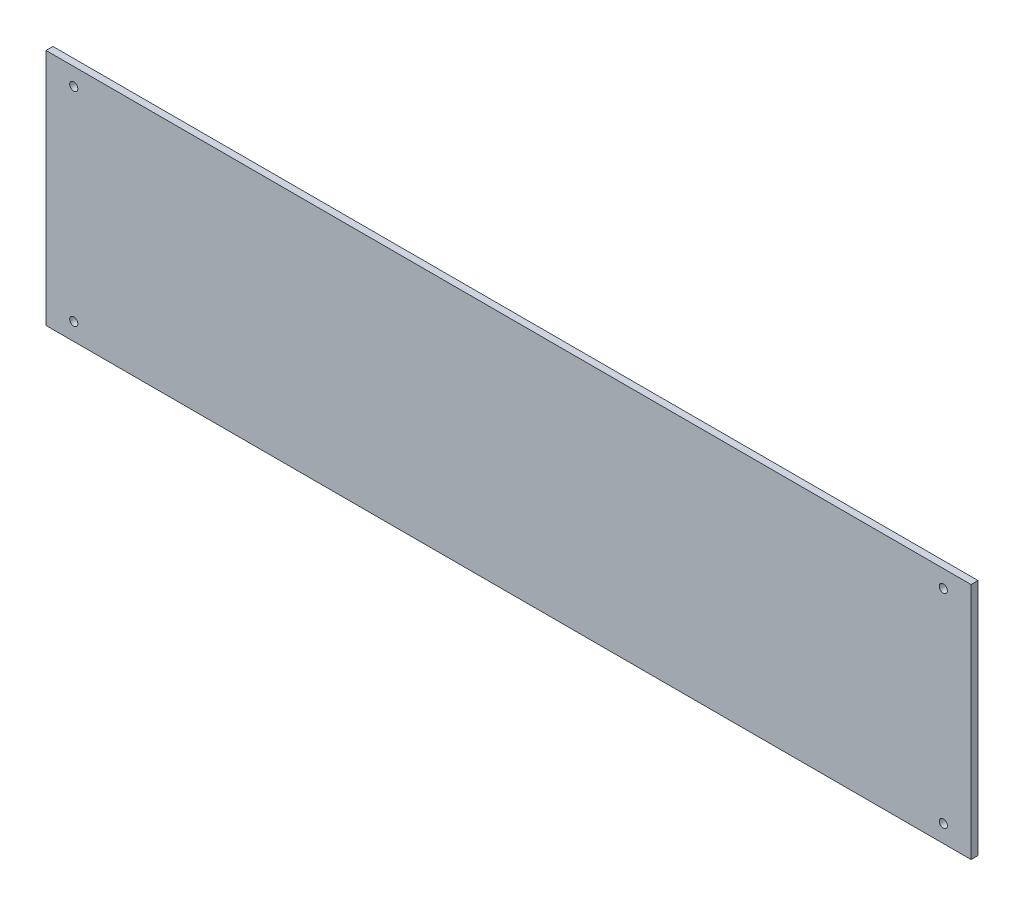
ISO-10303-21;
HEADER;
FILE_DESCRIPTION(('STEP AP214'),'2;1');
FILE_NAME('part.step','',(''),(''),'','','');
FILE_SCHEMA(('AUTOMOTIVE_DESIGN { 1 0 10303 214 1 1 1 1 }'));
ENDSEC;
DATA;
#1=APPLICATION_CONTEXT('core data for automotive mechanical design processes');
#2=APPLICATION_PROTOCOL_DEFINITION('international standard','automotive_design',2000,#1);
#3=PRODUCT_CONTEXT('',#1,'mechanical');
#4=PRODUCT('Part','Part','',(#3));
#5=PRODUCT_RELATED_PRODUCT_CATEGORY('part','',(#4));
#6=PRODUCT_DEFINITION_FORMATION('','',#4);
#7=PRODUCT_DEFINITION_CONTEXT('part definition',#1,'design');
#8=PRODUCT_DEFINITION('design','',#6,#7);
#9=PRODUCT_DEFINITION_SHAPE('','',#8);
#10=(LENGTH_UNIT() NAMED_UNIT(*) SI_UNIT(.MILLI.,.METRE.));
#11=(NAMED_UNIT(*) PLANE_ANGLE_UNIT() SI_UNIT($,.RADIAN.));
#12=(NAMED_UNIT(*) SI_UNIT($,.STERADIAN.) SOLID_ANGLE_UNIT());
#13=UNCERTAINTY_MEASURE_WITH_UNIT(LENGTH_MEASURE(1.E-05),#10,'distance_accuracy_value','');
#14=(GEOMETRIC_REPRESENTATION_CONTEXT(3) GLOBAL_UNCERTAINTY_ASSIGNED_CONTEXT((#13)) GLOBAL_UNIT_ASSIGNED_CONTEXT((#10,
#11,#12)) REPRESENTATION_CONTEXT('',''));
#15=CARTESIAN_POINT('',(0.,0.,0.));
#16=DIRECTION('',(0.,0.,1.));
#17=DIRECTION('',(1.,0.,0.));
#18=AXIS2_PLACEMENT_3D('',#15,#16,#17);
#19=CARTESIAN_POINT('',(0.,0.,3.));
#20=DIRECTION('',(1.,0.,0.));
#21=DIRECTION('',(0.,0.,-1.));
#22=AXIS2_PLACEMENT_3D('',#19,#20,#21);
#23=PLANE('',#22);
#24=DIRECTION('',(0.,-1.,0.));
#25=VECTOR('',#24,1.);
#26=CARTESIAN_POINT('',(0.,0.,0.));
#27=LINE('',#26,#25);
#28=CARTESIAN_POINT('',(0.,100.,0.));
#29=VERTEX_POINT('',#28);
#30=CARTESIAN_POINT('',(0.,-3.,0.));
#31=VERTEX_POINT('',#30);
#32=EDGE_CURVE('E78',#29,#31,#27,.T.);
#33=ORIENTED_EDGE('',*,*,#32,.T.);
#34=DIRECTION('',(0.,0.,-1.));
#35=VECTOR('',#34,1.);
#36=CARTESIAN_POINT('',(0.,-3.,0.));
#37=LINE('',#36,#35);
#38=CARTESIAN_POINT('',(0.,-3.,3.));
#39=VERTEX_POINT('',#38);
#40=EDGE_CURVE('E81',#39,#31,#37,.T.);
#41=ORIENTED_EDGE('',*,*,#40,.F.);
#42=DIRECTION('',(0.,-1.,0.));
#43=VECTOR('',#42,1.);
#44=CARTESIAN_POINT('',(0.,0.,3.));
#45=LINE('',#44,#43);
#46=CARTESIAN_POINT('',(0.,100.,3.));
#47=VERTEX_POINT('',#46);
#48=EDGE_CURVE('E65',#47,#39,#45,.T.);
#49=ORIENTED_EDGE('',*,*,#48,.F.);
#50=DIRECTION('',(0.,0.,-1.));
#51=VECTOR('',#50,1.);
#52=CARTESIAN_POINT('',(0.,100.,3.));
#53=LINE('',#52,#51);
#54=EDGE_CURVE('E41',#47,#29,#53,.T.);
#55=ORIENTED_EDGE('',*,*,#54,.T.);
#56=EDGE_LOOP('',(#33,#41,#49,#55));
#57=FACE_BOUND('',#56,.T.);
#58=ADVANCED_FACE('F33',(#57),#23,.F.);
#59=CARTESIAN_POINT('',(400.,0.,3.));
#60=DIRECTION('',(-1.,0.,0.));
#61=DIRECTION('',(0.,0.,1.));
#62=AXIS2_PLACEMENT_3D('',#59,#60,#61);
#63=PLANE('',#62);
#64=DIRECTION('',(0.,1.,0.));
#65=VECTOR('',#64,1.);
#66=CARTESIAN_POINT('',(400.,0.,0.));
#67=LINE('',#66,#65);
#68=CARTESIAN_POINT('',(400.,-3.,0.));
#69=VERTEX_POINT('',#68);
#70=CARTESIAN_POINT('',(400.,100.,0.));
#71=VERTEX_POINT('',#70);
#72=EDGE_CURVE('E60',#69,#71,#67,.T.);
#73=ORIENTED_EDGE('',*,*,#72,.T.);
#74=DIRECTION('',(0.,0.,-1.));
#75=VECTOR('',#74,1.);
#76=CARTESIAN_POINT('',(400.,100.,3.));
#77=LINE('',#76,#75);
#78=CARTESIAN_POINT('',(400.,100.,3.));
#79=VERTEX_POINT('',#78);
#80=EDGE_CURVE('E11',#79,#71,#77,.T.);
#81=ORIENTED_EDGE('',*,*,#80,.F.);
#82=DIRECTION('',(0.,1.,0.));
#83=VECTOR('',#82,1.);
#84=CARTESIAN_POINT('',(400.,0.,3.));
#85=LINE('',#84,#83);
#86=CARTESIAN_POINT('',(400.,-3.,3.00000000000005));
#87=VERTEX_POINT('',#86);
#88=EDGE_CURVE('E123',#87,#79,#85,.T.);
#89=ORIENTED_EDGE('',*,*,#88,.F.);
#90=DIRECTION('',(0.,0.,1.));
#91=VECTOR('',#90,1.);
#92=CARTESIAN_POINT('',(400.,-3.,0.));
#93=LINE('',#92,#91);
#94=EDGE_CURVE('E91',#69,#87,#93,.T.);
#95=ORIENTED_EDGE('',*,*,#94,.F.);
#96=EDGE_LOOP('',(#73,#81,#89,#95));
#97=FACE_BOUND('',#96,.T.);
#98=ADVANCED_FACE('F130',(#97),#63,.F.);
#99=CARTESIAN_POINT('',(0.,100.,3.));
#100=DIRECTION('',(0.,-1.,0.));
#101=DIRECTION('',(0.,0.,-1.));
#102=AXIS2_PLACEMENT_3D('',#99,#100,#101);
#103=PLANE('',#102);
#104=DIRECTION('',(-1.,0.,0.));
#105=VECTOR('',#104,1.);
#106=CARTESIAN_POINT('',(0.,100.,0.));
#107=LINE('',#106,#105);
#108=EDGE_CURVE('E124',#71,#29,#107,.T.);
#109=ORIENTED_EDGE('',*,*,#108,.T.);
#110=ORIENTED_EDGE('',*,*,#54,.F.);
#111=DIRECTION('',(-1.,0.,0.));
#112=VECTOR('',#111,1.);
#113=CARTESIAN_POINT('',(0.,100.,3.));
#114=LINE('',#113,#112);
#115=EDGE_CURVE('E49',#79,#47,#114,.T.);
#116=ORIENTED_EDGE('',*,*,#115,.F.);
#117=ORIENTED_EDGE('',*,*,#80,.T.);
#118=EDGE_LOOP('',(#109,#110,#116,#117));
#119=FACE_BOUND('',#118,.T.);
#120=ADVANCED_FACE('F129',(#119),#103,.F.);
#121=CARTESIAN_POINT('',(0.,0.,3.));
#122=DIRECTION('',(0.,0.,-1.));
#123=DIRECTION('',(-1.,0.,0.));
#124=AXIS2_PLACEMENT_3D('',#121,#122,#123);
#125=PLANE('',#124);
#126=CARTESIAN_POINT('',(388.,4.5,3.));
#127=DIRECTION('',(0.,0.,-1.));
#128=DIRECTION('',(1.,0.,0.));
#129=AXIS2_PLACEMENT_3D('',#126,#127,#128);
#130=CIRCLE('',#129,1.74999999999998);
#131=CARTESIAN_POINT('',(389.75,4.5,3.));
#132=VERTEX_POINT('',#131);
#133=EDGE_CURVE('E100',#132,#132,#130,.T.);
#134=ORIENTED_EDGE('',*,*,#133,.T.);
#135=EDGE_LOOP('',(#134));
#136=FACE_BOUND('',#135,.T.);
#137=CARTESIAN_POINT('',(12.,92.5,3.));
#138=DIRECTION('',(0.,0.,-1.));
#139=DIRECTION('',(1.,0.,0.));
#140=AXIS2_PLACEMENT_3D('',#137,#138,#139);
#141=CIRCLE('',#140,1.74999999999998);
#142=CARTESIAN_POINT('',(13.75,92.5,3.));
#143=VERTEX_POINT('',#142);
#144=EDGE_CURVE('E107',#143,#143,#141,.T.);
#145=ORIENTED_EDGE('',*,*,#144,.T.);
#146=EDGE_LOOP('',(#145));
#147=FACE_BOUND('',#146,.T.);
#148=CARTESIAN_POINT('',(12.,4.50000000000003,3.));
#149=DIRECTION('',(0.,0.,-1.));
#150=DIRECTION('',(-1.,0.,0.));
#151=AXIS2_PLACEMENT_3D('',#148,#149,#150);
#152=CIRCLE('',#151,1.74999999999998);
#153=CARTESIAN_POINT('',(10.25,4.50000000000003,3.));
#154=VERTEX_POINT('',#153);
#155=EDGE_CURVE('E113',#154,#154,#152,.T.);
#156=ORIENTED_EDGE('',*,*,#155,.T.);
#157=EDGE_LOOP('',(#156));
#158=FACE_BOUND('',#157,.T.);
#159=CARTESIAN_POINT('',(388.,92.5,3.));
#160=DIRECTION('',(0.,0.,-1.));
#161=DIRECTION('',(-1.,0.,0.));
#162=AXIS2_PLACEMENT_3D('',#159,#160,#161);
#163=CIRCLE('',#162,1.74999999999998);
#164=CARTESIAN_POINT('',(386.25,92.5,3.));
#165=VERTEX_POINT('',#164);
#166=EDGE_CURVE('E84',#165,#165,#163,.T.);
#167=ORIENTED_EDGE('',*,*,#166,.T.);
#168=EDGE_LOOP('',(#167));
#169=FACE_BOUND('',#168,.T.);
#170=ORIENTED_EDGE('',*,*,#48,.T.);
#171=DIRECTION('',(-1.,0.,0.));
#172=VECTOR('',#171,1.);
#173=CARTESIAN_POINT('',(0.,-3.,3.));
#174=LINE('',#173,#172);
#175=EDGE_CURVE('E94',#87,#39,#174,.T.);
#176=ORIENTED_EDGE('',*,*,#175,.F.);
#177=ORIENTED_EDGE('',*,*,#88,.T.);
#178=ORIENTED_EDGE('',*,*,#115,.T.);
#179=EDGE_LOOP('',(#170,#176,#177,#178));
#180=FACE_BOUND('',#179,.T.);
#181=ADVANCED_FACE('F131',(#136,#147,#158,#169,#180),#125,.F.);
#182=CARTESIAN_POINT('',(0.,0.,0.));
#183=DIRECTION('',(0.,0.,-1.));
#184=DIRECTION('',(-1.,0.,0.));
#185=AXIS2_PLACEMENT_3D('',#182,#183,#184);
#186=PLANE('',#185);
#187=CARTESIAN_POINT('',(388.,4.5,0.));
#188=DIRECTION('',(0.,0.,-1.));
#189=DIRECTION('',(1.,0.,0.));
#190=AXIS2_PLACEMENT_3D('',#187,#188,#189);
#191=CIRCLE('',#190,1.74999999999998);
#192=CARTESIAN_POINT('',(389.75,4.5,0.));
#193=VERTEX_POINT('',#192);
#194=EDGE_CURVE('E104',#193,#193,#191,.T.);
#195=ORIENTED_EDGE('',*,*,#194,.F.);
#196=EDGE_LOOP('',(#195));
#197=FACE_BOUND('',#196,.T.);
#198=CARTESIAN_POINT('',(12.,92.5,0.));
#199=DIRECTION('',(0.,0.,-1.));
#200=DIRECTION('',(1.,0.,0.));
#201=AXIS2_PLACEMENT_3D('',#198,#199,#200);
#202=CIRCLE('',#201,1.74999999999998);
#203=CARTESIAN_POINT('',(13.75,92.5,0.));
#204=VERTEX_POINT('',#203);
#205=EDGE_CURVE('E110',#204,#204,#202,.T.);
#206=ORIENTED_EDGE('',*,*,#205,.F.);
#207=EDGE_LOOP('',(#206));
#208=FACE_BOUND('',#207,.T.);
#209=CARTESIAN_POINT('',(12.,4.50000000000003,0.));
#210=DIRECTION('',(0.,0.,-1.));
#211=DIRECTION('',(-1.,0.,0.));
#212=AXIS2_PLACEMENT_3D('',#209,#210,#211);
#213=CIRCLE('',#212,1.74999999999998);
#214=CARTESIAN_POINT('',(10.25,4.50000000000003,0.));
#215=VERTEX_POINT('',#214);
#216=EDGE_CURVE('E99',#215,#215,#213,.T.);
#217=ORIENTED_EDGE('',*,*,#216,.F.);
#218=EDGE_LOOP('',(#217));
#219=FACE_BOUND('',#218,.T.);
#220=CARTESIAN_POINT('',(388.,92.5,0.));
#221=DIRECTION('',(0.,0.,-1.));
#222=DIRECTION('',(-1.,0.,0.));
#223=AXIS2_PLACEMENT_3D('',#220,#221,#222);
#224=CIRCLE('',#223,1.74999999999998);
#225=CARTESIAN_POINT('',(386.25,92.5,0.));
#226=VERTEX_POINT('',#225);
#227=EDGE_CURVE('E103',#226,#226,#224,.T.);
#228=ORIENTED_EDGE('',*,*,#227,.F.);
#229=EDGE_LOOP('',(#228));
#230=FACE_BOUND('',#229,.T.);
#231=ORIENTED_EDGE('',*,*,#32,.F.);
#232=ORIENTED_EDGE('',*,*,#108,.F.);
#233=ORIENTED_EDGE('',*,*,#72,.F.);
#234=DIRECTION('',(1.,0.,0.));
#235=VECTOR('',#234,1.);
#236=CARTESIAN_POINT('',(0.,-3.,0.));
#237=LINE('',#236,#235);
#238=EDGE_CURVE('E87',#31,#69,#237,.T.);
#239=ORIENTED_EDGE('',*,*,#238,.F.);
#240=EDGE_LOOP('',(#231,#232,#233,#239));
#241=FACE_BOUND('',#240,.T.);
#242=ADVANCED_FACE('F88',(#197,#208,#219,#230,#241),#186,.T.);
#243=CARTESIAN_POINT('',(388.,92.5,3.));
#244=DIRECTION('',(0.,0.,-1.));
#245=DIRECTION('',(-1.,0.,0.));
#246=AXIS2_PLACEMENT_3D('',#243,#244,#245);
#247=CYLINDRICAL_SURFACE('',#246,1.74999999999998);
#248=ORIENTED_EDGE('',*,*,#166,.F.);
#249=EDGE_LOOP('',(#248));
#250=FACE_BOUND('',#249,.T.);
#251=ORIENTED_EDGE('',*,*,#227,.T.);
#252=EDGE_LOOP('',(#251));
#253=FACE_BOUND('',#252,.T.);
#254=ADVANCED_FACE('F139',(#250,#253),#247,.F.);
#255=CARTESIAN_POINT('',(12.,4.50000000000003,3.));
#256=DIRECTION('',(0.,0.,-1.));
#257=DIRECTION('',(-1.,0.,0.));
#258=AXIS2_PLACEMENT_3D('',#255,#256,#257);
#259=CYLINDRICAL_SURFACE('',#258,1.74999999999998);
#260=ORIENTED_EDGE('',*,*,#155,.F.);
#261=EDGE_LOOP('',(#260));
#262=FACE_BOUND('',#261,.T.);
#263=ORIENTED_EDGE('',*,*,#216,.T.);
#264=EDGE_LOOP('',(#263));
#265=FACE_BOUND('',#264,.T.);
#266=ADVANCED_FACE('F166',(#262,#265),#259,.F.);
#267=CARTESIAN_POINT('',(12.,92.5,3.));
#268=DIRECTION('',(0.,0.,-1.));
#269=DIRECTION('',(-1.,0.,0.));
#270=AXIS2_PLACEMENT_3D('',#267,#268,#269);
#271=CYLINDRICAL_SURFACE('',#270,1.74999999999998);
#272=ORIENTED_EDGE('',*,*,#144,.F.);
#273=EDGE_LOOP('',(#272));
#274=FACE_BOUND('',#273,.T.);
#275=ORIENTED_EDGE('',*,*,#205,.T.);
#276=EDGE_LOOP('',(#275));
#277=FACE_BOUND('',#276,.T.);
#278=ADVANCED_FACE('F176',(#274,#277),#271,.F.);
#279=CARTESIAN_POINT('',(388.,4.5,3.));
#280=DIRECTION('',(0.,0.,-1.));
#281=DIRECTION('',(-1.,0.,0.));
#282=AXIS2_PLACEMENT_3D('',#279,#280,#281);
#283=CYLINDRICAL_SURFACE('',#282,1.74999999999998);
#284=ORIENTED_EDGE('',*,*,#133,.F.);
#285=EDGE_LOOP('',(#284));
#286=FACE_BOUND('',#285,.T.);
#287=ORIENTED_EDGE('',*,*,#194,.T.);
#288=EDGE_LOOP('',(#287));
#289=FACE_BOUND('',#288,.T.);
#290=ADVANCED_FACE('F186',(#286,#289),#283,.F.);
#291=CARTESIAN_POINT('',(0.,-3.,0.));
#292=DIRECTION('',(0.,1.,0.));
#293=DIRECTION('',(0.,0.,1.));
#294=AXIS2_PLACEMENT_3D('',#291,#292,#293);
#295=PLANE('',#294);
#296=ORIENTED_EDGE('',*,*,#40,.T.);
#297=ORIENTED_EDGE('',*,*,#238,.T.);
#298=ORIENTED_EDGE('',*,*,#94,.T.);
#299=ORIENTED_EDGE('',*,*,#175,.T.);
#300=EDGE_LOOP('',(#296,#297,#298,#299));
#301=FACE_BOUND('',#300,.T.);
#302=ADVANCED_FACE('F93',(#301),#295,.F.);
#303=CLOSED_SHELL('',(#58,#98,#120,#181,#242,#254,#266,#278,#290,#302));
#304=MANIFOLD_SOLID_BREP('B2',#303);
#305=ADVANCED_BREP_SHAPE_REPRESENTATION('',(#18,#304),#14);
#306=SHAPE_DEFINITION_REPRESENTATION(#9,#305);
ENDSEC;
END-ISO-10303-21;
